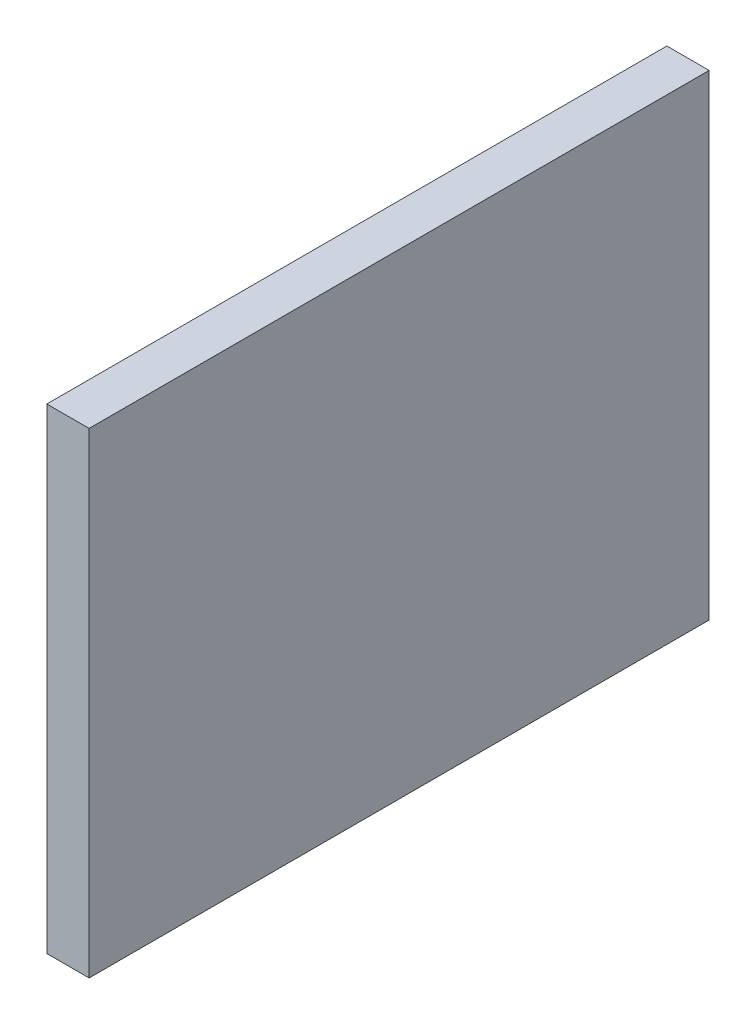
ISO-10303-21;
HEADER;
FILE_DESCRIPTION(('STEP AP214'),'2;1');
FILE_NAME('part.step','',(''),(''),'','','');
FILE_SCHEMA(('AUTOMOTIVE_DESIGN { 1 0 10303 214 1 1 1 1 }'));
ENDSEC;
DATA;
#1=APPLICATION_CONTEXT('core data for automotive mechanical design processes');
#2=APPLICATION_PROTOCOL_DEFINITION('international standard','automotive_design',2000,#1);
#3=PRODUCT_CONTEXT('',#1,'mechanical');
#4=PRODUCT('Part','Part','',(#3));
#5=PRODUCT_RELATED_PRODUCT_CATEGORY('part','',(#4));
#6=PRODUCT_DEFINITION_FORMATION('','',#4);
#7=PRODUCT_DEFINITION_CONTEXT('part definition',#1,'design');
#8=PRODUCT_DEFINITION('design','',#6,#7);
#9=PRODUCT_DEFINITION_SHAPE('','',#8);
#10=(LENGTH_UNIT() NAMED_UNIT(*) SI_UNIT(.MILLI.,.METRE.));
#11=(NAMED_UNIT(*) PLANE_ANGLE_UNIT() SI_UNIT($,.RADIAN.));
#12=(NAMED_UNIT(*) SI_UNIT($,.STERADIAN.) SOLID_ANGLE_UNIT());
#13=UNCERTAINTY_MEASURE_WITH_UNIT(LENGTH_MEASURE(1.E-05),#10,'distance_accuracy_value','');
#14=(GEOMETRIC_REPRESENTATION_CONTEXT(3) GLOBAL_UNCERTAINTY_ASSIGNED_CONTEXT((#13)) GLOBAL_UNIT_ASSIGNED_CONTEXT((#10,
#11,#12)) REPRESENTATION_CONTEXT('',''));
#15=CARTESIAN_POINT('',(0.,0.,0.));
#16=DIRECTION('',(0.,0.,1.));
#17=DIRECTION('',(1.,0.,0.));
#18=AXIS2_PLACEMENT_3D('',#15,#16,#17);
#19=CARTESIAN_POINT('',(3.,-56.7136635749748,-41.0383830188961));
#20=DIRECTION('',(0.,0.,1.));
#21=DIRECTION('',(0.,-1.,0.));
#22=AXIS2_PLACEMENT_3D('',#19,#20,#21);
#23=PLANE('',#22);
#24=DIRECTION('',(0.,1.,0.));
#25=VECTOR('',#24,1.);
#26=CARTESIAN_POINT('',(0.,-56.7136635749748,-41.0383830188961));
#27=LINE('',#26,#25);
#28=CARTESIAN_POINT('',(0.,-56.7136635749748,-41.0383830188961));
#29=VERTEX_POINT('',#28);
#30=CARTESIAN_POINT('',(0.,-22.9377393033587,-41.0383830188961));
#31=VERTEX_POINT('',#30);
#32=EDGE_CURVE('E96',#29,#31,#27,.T.);
#33=ORIENTED_EDGE('',*,*,#32,.T.);
#34=DIRECTION('',(-1.,0.,0.));
#35=VECTOR('',#34,1.);
#36=CARTESIAN_POINT('',(3.,-22.9377393033587,-41.0383830188961));
#37=LINE('',#36,#35);
#38=CARTESIAN_POINT('',(3.,-22.9377393033587,-41.0383830188961));
#39=VERTEX_POINT('',#38);
#40=EDGE_CURVE('E11',#39,#31,#37,.T.);
#41=ORIENTED_EDGE('',*,*,#40,.F.);
#42=DIRECTION('',(0.,1.,0.));
#43=VECTOR('',#42,1.);
#44=CARTESIAN_POINT('',(3.,-56.7136635749748,-41.0383830188961));
#45=LINE('',#44,#43);
#46=CARTESIAN_POINT('',(3.,-56.7136635749748,-41.0383830188961));
#47=VERTEX_POINT('',#46);
#48=EDGE_CURVE('E84',#47,#39,#45,.T.);
#49=ORIENTED_EDGE('',*,*,#48,.F.);
#50=DIRECTION('',(-1.,0.,0.));
#51=VECTOR('',#50,1.);
#52=CARTESIAN_POINT('',(3.,-56.7136635749748,-41.0383830188961));
#53=LINE('',#52,#51);
#54=EDGE_CURVE('E92',#47,#29,#53,.T.);
#55=ORIENTED_EDGE('',*,*,#54,.T.);
#56=EDGE_LOOP('',(#33,#41,#49,#55));
#57=FACE_BOUND('',#56,.T.);
#58=ADVANCED_FACE('F33',(#57),#23,.F.);
#59=CARTESIAN_POINT('',(3.,-22.9377393033587,2.96161698110385));
#60=DIRECTION('',(0.,-1.,0.));
#61=DIRECTION('',(0.,0.,-1.));
#62=AXIS2_PLACEMENT_3D('',#59,#60,#61);
#63=PLANE('',#62);
#64=DIRECTION('',(0.,0.,1.));
#65=VECTOR('',#64,1.);
#66=CARTESIAN_POINT('',(0.,-22.9377393033587,2.96161698110385));
#67=LINE('',#66,#65);
#68=CARTESIAN_POINT('',(0.,-22.9377393033587,2.96161698110385));
#69=VERTEX_POINT('',#68);
#70=EDGE_CURVE('E88',#31,#69,#67,.T.);
#71=ORIENTED_EDGE('',*,*,#70,.T.);
#72=DIRECTION('',(-1.,0.,0.));
#73=VECTOR('',#72,1.);
#74=CARTESIAN_POINT('',(3.,-22.9377393033587,2.96161698110385));
#75=LINE('',#74,#73);
#76=CARTESIAN_POINT('',(3.,-22.9377393033587,2.96161698110385));
#77=VERTEX_POINT('',#76);
#78=EDGE_CURVE('E41',#77,#69,#75,.T.);
#79=ORIENTED_EDGE('',*,*,#78,.F.);
#80=DIRECTION('',(0.,0.,1.));
#81=VECTOR('',#80,1.);
#82=CARTESIAN_POINT('',(3.,-22.9377393033587,2.96161698110385));
#83=LINE('',#82,#81);
#84=EDGE_CURVE('E79',#39,#77,#83,.T.);
#85=ORIENTED_EDGE('',*,*,#84,.F.);
#86=ORIENTED_EDGE('',*,*,#40,.T.);
#87=EDGE_LOOP('',(#71,#79,#85,#86));
#88=FACE_BOUND('',#87,.T.);
#89=ADVANCED_FACE('F87',(#88),#63,.F.);
#90=CARTESIAN_POINT('',(3.,-56.7136635749748,2.96161698110385));
#91=DIRECTION('',(0.,0.,-1.));
#92=DIRECTION('',(-1.,0.,0.));
#93=AXIS2_PLACEMENT_3D('',#90,#91,#92);
#94=PLANE('',#93);
#95=DIRECTION('',(0.,-1.,0.));
#96=VECTOR('',#95,1.);
#97=CARTESIAN_POINT('',(0.,-56.7136635749748,2.96161698110385));
#98=LINE('',#97,#96);
#99=CARTESIAN_POINT('',(0.,-56.7136635749748,2.96161698110385));
#100=VERTEX_POINT('',#99);
#101=EDGE_CURVE('E66',#69,#100,#98,.T.);
#102=ORIENTED_EDGE('',*,*,#101,.T.);
#103=DIRECTION('',(-1.,0.,0.));
#104=VECTOR('',#103,1.);
#105=CARTESIAN_POINT('',(3.,-56.7136635749748,2.96161698110385));
#106=LINE('',#105,#104);
#107=CARTESIAN_POINT('',(3.,-56.7136635749748,2.96161698110385));
#108=VERTEX_POINT('',#107);
#109=EDGE_CURVE('E89',#108,#100,#106,.T.);
#110=ORIENTED_EDGE('',*,*,#109,.F.);
#111=DIRECTION('',(0.,-1.,0.));
#112=VECTOR('',#111,1.);
#113=CARTESIAN_POINT('',(3.,-56.7136635749748,2.96161698110385));
#114=LINE('',#113,#112);
#115=EDGE_CURVE('E82',#77,#108,#114,.T.);
#116=ORIENTED_EDGE('',*,*,#115,.F.);
#117=ORIENTED_EDGE('',*,*,#78,.T.);
#118=EDGE_LOOP('',(#102,#110,#116,#117));
#119=FACE_BOUND('',#118,.T.);
#120=ADVANCED_FACE('F90',(#119),#94,.F.);
#121=CARTESIAN_POINT('',(3.,-56.7136635749748,2.96161698110385));
#122=DIRECTION('',(0.,1.,0.));
#123=DIRECTION('',(0.,0.,1.));
#124=AXIS2_PLACEMENT_3D('',#121,#122,#123);
#125=PLANE('',#124);
#126=DIRECTION('',(0.,0.,-1.));
#127=VECTOR('',#126,1.);
#128=CARTESIAN_POINT('',(0.,-56.7136635749748,2.96161698110385));
#129=LINE('',#128,#127);
#130=EDGE_CURVE('E72',#100,#29,#129,.T.);
#131=ORIENTED_EDGE('',*,*,#130,.T.);
#132=ORIENTED_EDGE('',*,*,#54,.F.);
#133=DIRECTION('',(0.,0.,-1.));
#134=VECTOR('',#133,1.);
#135=CARTESIAN_POINT('',(3.,-56.7136635749748,2.96161698110385));
#136=LINE('',#135,#134);
#137=EDGE_CURVE('E49',#108,#47,#136,.T.);
#138=ORIENTED_EDGE('',*,*,#137,.F.);
#139=ORIENTED_EDGE('',*,*,#109,.T.);
#140=EDGE_LOOP('',(#131,#132,#138,#139));
#141=FACE_BOUND('',#140,.T.);
#142=ADVANCED_FACE('F103',(#141),#125,.F.);
#143=CARTESIAN_POINT('',(3.,0.,0.));
#144=DIRECTION('',(-1.,0.,0.));
#145=DIRECTION('',(0.,0.,1.));
#146=AXIS2_PLACEMENT_3D('',#143,#144,#145);
#147=PLANE('',#146);
#148=ORIENTED_EDGE('',*,*,#48,.T.);
#149=ORIENTED_EDGE('',*,*,#84,.T.);
#150=ORIENTED_EDGE('',*,*,#115,.T.);
#151=ORIENTED_EDGE('',*,*,#137,.T.);
#152=EDGE_LOOP('',(#148,#149,#150,#151));
#153=FACE_BOUND('',#152,.T.);
#154=ADVANCED_FACE('F80',(#153),#147,.F.);
#155=CARTESIAN_POINT('',(0.,0.,0.));
#156=DIRECTION('',(-1.,0.,0.));
#157=DIRECTION('',(0.,0.,1.));
#158=AXIS2_PLACEMENT_3D('',#155,#156,#157);
#159=PLANE('',#158);
#160=ORIENTED_EDGE('',*,*,#32,.F.);
#161=ORIENTED_EDGE('',*,*,#130,.F.);
#162=ORIENTED_EDGE('',*,*,#101,.F.);
#163=ORIENTED_EDGE('',*,*,#70,.F.);
#164=EDGE_LOOP('',(#160,#161,#162,#163));
#165=FACE_BOUND('',#164,.T.);
#166=ADVANCED_FACE('F106',(#165),#159,.T.);
#167=CLOSED_SHELL('',(#58,#89,#120,#142,#154,#166));
#168=MANIFOLD_SOLID_BREP('B2',#167);
#169=ADVANCED_BREP_SHAPE_REPRESENTATION('',(#18,#168),#14);
#170=SHAPE_DEFINITION_REPRESENTATION(#9,#169);
ENDSEC;
END-ISO-10303-21;
